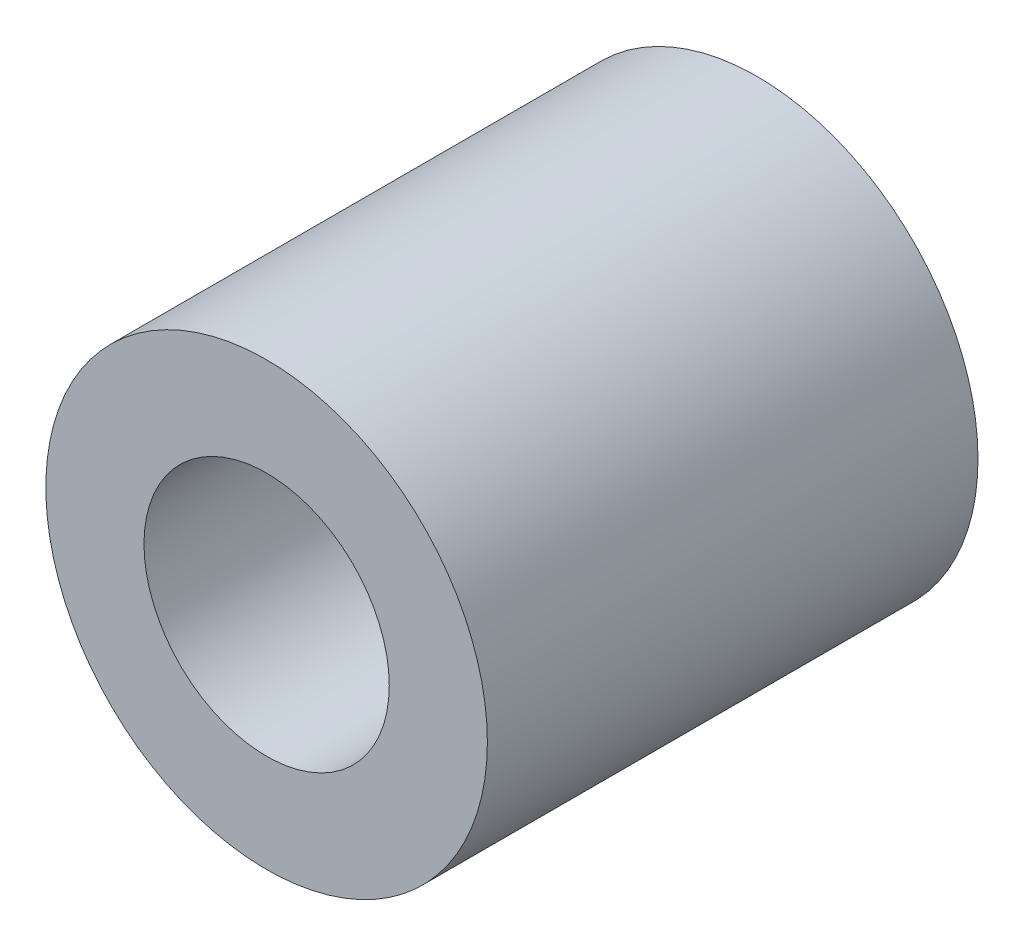
ISO-10303-21;
HEADER;
FILE_DESCRIPTION(('STEP AP214'),'2;1');
FILE_NAME('part.step','',(''),(''),'','','');
FILE_SCHEMA(('AUTOMOTIVE_DESIGN { 1 0 10303 214 1 1 1 1 }'));
ENDSEC;
DATA;
#1=APPLICATION_CONTEXT('core data for automotive mechanical design processes');
#2=APPLICATION_PROTOCOL_DEFINITION('international standard','automotive_design',2000,#1);
#3=PRODUCT_CONTEXT('',#1,'mechanical');
#4=PRODUCT('Part','Part','',(#3));
#5=PRODUCT_RELATED_PRODUCT_CATEGORY('part','',(#4));
#6=PRODUCT_DEFINITION_FORMATION('','',#4);
#7=PRODUCT_DEFINITION_CONTEXT('part definition',#1,'design');
#8=PRODUCT_DEFINITION('design','',#6,#7);
#9=PRODUCT_DEFINITION_SHAPE('','',#8);
#10=(LENGTH_UNIT() NAMED_UNIT(*) SI_UNIT(.MILLI.,.METRE.));
#11=(NAMED_UNIT(*) PLANE_ANGLE_UNIT() SI_UNIT($,.RADIAN.));
#12=(NAMED_UNIT(*) SI_UNIT($,.STERADIAN.) SOLID_ANGLE_UNIT());
#13=UNCERTAINTY_MEASURE_WITH_UNIT(LENGTH_MEASURE(1.E-05),#10,'distance_accuracy_value','');
#14=(GEOMETRIC_REPRESENTATION_CONTEXT(3) GLOBAL_UNCERTAINTY_ASSIGNED_CONTEXT((#13)) GLOBAL_UNIT_ASSIGNED_CONTEXT((#10,
#11,#12)) REPRESENTATION_CONTEXT('',''));
#15=CARTESIAN_POINT('',(0.,0.,0.));
#16=DIRECTION('',(0.,0.,1.));
#17=DIRECTION('',(1.,0.,0.));
#18=AXIS2_PLACEMENT_3D('',#15,#16,#17);
#19=CARTESIAN_POINT('',(0.,0.,7.));
#20=DIRECTION('',(0.,0.,1.));
#21=DIRECTION('',(1.,0.,0.));
#22=AXIS2_PLACEMENT_3D('',#19,#20,#21);
#23=PLANE('',#22);
#24=CARTESIAN_POINT('',(0.,0.,7.));
#25=DIRECTION('',(0.,0.,1.));
#26=DIRECTION('',(1.,0.,0.));
#27=AXIS2_PLACEMENT_3D('',#24,#25,#26);
#28=CIRCLE('',#27,3.15);
#29=CARTESIAN_POINT('',(3.15,0.,7.));
#30=VERTEX_POINT('',#29);
#31=EDGE_CURVE('E10',#30,#30,#28,.T.);
#32=ORIENTED_EDGE('',*,*,#31,.T.);
#33=EDGE_LOOP('',(#32));
#34=FACE_BOUND('',#33,.T.);
#35=CARTESIAN_POINT('',(0.,0.,7.));
#36=DIRECTION('',(0.,0.,1.));
#37=DIRECTION('',(1.,0.,0.));
#38=AXIS2_PLACEMENT_3D('',#35,#36,#37);
#39=CIRCLE('',#38,1.75);
#40=CARTESIAN_POINT('',(1.75,0.,7.));
#41=VERTEX_POINT('',#40);
#42=EDGE_CURVE('E41',#41,#41,#39,.T.);
#43=ORIENTED_EDGE('',*,*,#42,.F.);
#44=EDGE_LOOP('',(#43));
#45=FACE_BOUND('',#44,.T.);
#46=ADVANCED_FACE('F30',(#34,#45),#23,.T.);
#47=CARTESIAN_POINT('',(0.,0.,0.));
#48=DIRECTION('',(0.,0.,1.));
#49=DIRECTION('',(1.,0.,0.));
#50=AXIS2_PLACEMENT_3D('',#47,#48,#49);
#51=PLANE('',#50);
#52=CARTESIAN_POINT('',(0.,0.,0.));
#53=DIRECTION('',(0.,0.,1.));
#54=DIRECTION('',(1.,0.,0.));
#55=AXIS2_PLACEMENT_3D('',#52,#53,#54);
#56=CIRCLE('',#55,3.15);
#57=CARTESIAN_POINT('',(3.15,0.,0.));
#58=VERTEX_POINT('',#57);
#59=EDGE_CURVE('E34',#58,#58,#56,.T.);
#60=ORIENTED_EDGE('',*,*,#59,.F.);
#61=EDGE_LOOP('',(#60));
#62=FACE_BOUND('',#61,.T.);
#63=CARTESIAN_POINT('',(0.,0.,0.));
#64=DIRECTION('',(0.,0.,1.));
#65=DIRECTION('',(1.,0.,0.));
#66=AXIS2_PLACEMENT_3D('',#63,#64,#65);
#67=CIRCLE('',#66,1.75);
#68=CARTESIAN_POINT('',(1.75,0.,0.));
#69=VERTEX_POINT('',#68);
#70=EDGE_CURVE('E43',#69,#69,#67,.T.);
#71=ORIENTED_EDGE('',*,*,#70,.T.);
#72=EDGE_LOOP('',(#71));
#73=FACE_BOUND('',#72,.T.);
#74=ADVANCED_FACE('F53',(#62,#73),#51,.F.);
#75=CARTESIAN_POINT('',(0.,0.,7.));
#76=DIRECTION('',(0.,0.,-1.));
#77=DIRECTION('',(-1.,0.,0.));
#78=AXIS2_PLACEMENT_3D('',#75,#76,#77);
#79=CYLINDRICAL_SURFACE('',#78,3.15);
#80=ORIENTED_EDGE('',*,*,#31,.F.);
#81=EDGE_LOOP('',(#80));
#82=FACE_BOUND('',#81,.T.);
#83=ORIENTED_EDGE('',*,*,#59,.T.);
#84=EDGE_LOOP('',(#83));
#85=FACE_BOUND('',#84,.T.);
#86=ADVANCED_FACE('F32',(#82,#85),#79,.T.);
#87=CARTESIAN_POINT('',(0.,0.,7.));
#88=DIRECTION('',(0.,0.,-1.));
#89=DIRECTION('',(-1.,0.,0.));
#90=AXIS2_PLACEMENT_3D('',#87,#88,#89);
#91=CYLINDRICAL_SURFACE('',#90,1.75);
#92=ORIENTED_EDGE('',*,*,#42,.T.);
#93=EDGE_LOOP('',(#92));
#94=FACE_BOUND('',#93,.T.);
#95=ORIENTED_EDGE('',*,*,#70,.F.);
#96=EDGE_LOOP('',(#95));
#97=FACE_BOUND('',#96,.T.);
#98=ADVANCED_FACE('F49',(#94,#97),#91,.F.);
#99=CLOSED_SHELL('',(#46,#74,#86,#98));
#100=MANIFOLD_SOLID_BREP('B2',#99);
#101=ADVANCED_BREP_SHAPE_REPRESENTATION('',(#18,#100),#14);
#102=SHAPE_DEFINITION_REPRESENTATION(#9,#101);
ENDSEC;
END-ISO-10303-21;
